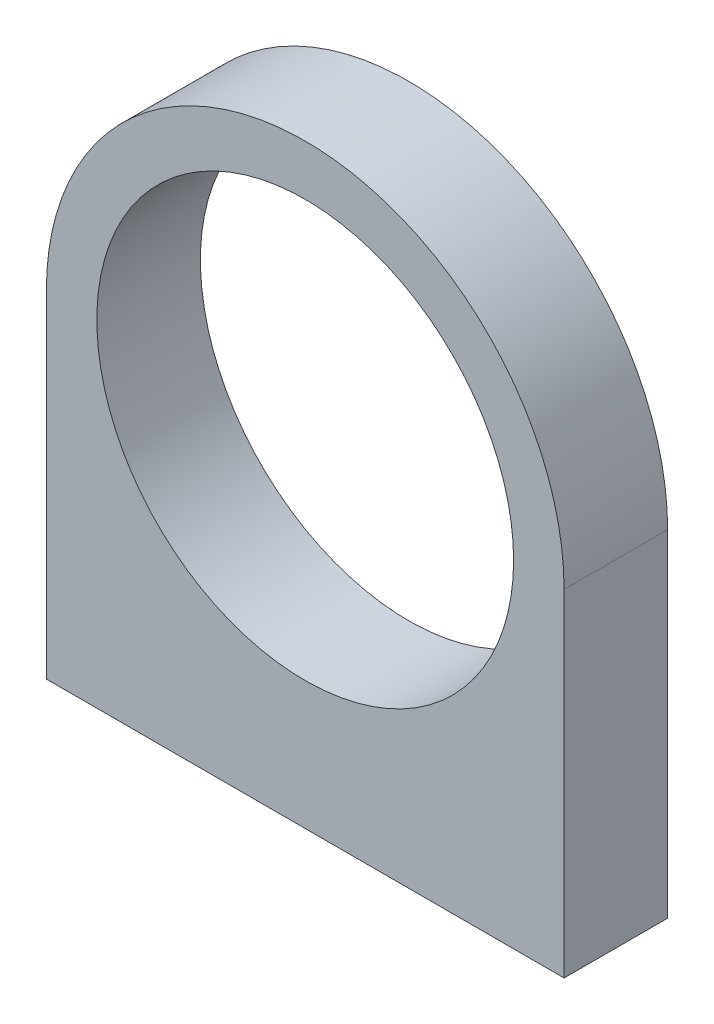
ISO-10303-21;
HEADER;
FILE_DESCRIPTION(('STEP AP214'),'2;1');
FILE_NAME('part.step','',(''),(''),'','','');
FILE_SCHEMA(('AUTOMOTIVE_DESIGN { 1 0 10303 214 1 1 1 1 }'));
ENDSEC;
DATA;
#1=APPLICATION_CONTEXT('core data for automotive mechanical design processes');
#2=APPLICATION_PROTOCOL_DEFINITION('international standard','automotive_design',2000,#1);
#3=PRODUCT_CONTEXT('',#1,'mechanical');
#4=PRODUCT('Part','Part','',(#3));
#5=PRODUCT_RELATED_PRODUCT_CATEGORY('part','',(#4));
#6=PRODUCT_DEFINITION_FORMATION('','',#4);
#7=PRODUCT_DEFINITION_CONTEXT('part definition',#1,'design');
#8=PRODUCT_DEFINITION('design','',#6,#7);
#9=PRODUCT_DEFINITION_SHAPE('','',#8);
#10=(LENGTH_UNIT() NAMED_UNIT(*) SI_UNIT(.MILLI.,.METRE.));
#11=(NAMED_UNIT(*) PLANE_ANGLE_UNIT() SI_UNIT($,.RADIAN.));
#12=(NAMED_UNIT(*) SI_UNIT($,.STERADIAN.) SOLID_ANGLE_UNIT());
#13=UNCERTAINTY_MEASURE_WITH_UNIT(LENGTH_MEASURE(1.E-05),#10,'distance_accuracy_value','');
#14=(GEOMETRIC_REPRESENTATION_CONTEXT(3) GLOBAL_UNCERTAINTY_ASSIGNED_CONTEXT((#13)) GLOBAL_UNIT_ASSIGNED_CONTEXT((#10,
#11,#12)) REPRESENTATION_CONTEXT('',''));
#15=CARTESIAN_POINT('',(0.,0.,0.));
#16=DIRECTION('',(0.,0.,1.));
#17=DIRECTION('',(1.,0.,0.));
#18=AXIS2_PLACEMENT_3D('',#15,#16,#17);
#19=CARTESIAN_POINT('',(0.,0.,8.));
#20=DIRECTION('',(0.,0.,-1.));
#21=DIRECTION('',(-1.,0.,0.));
#22=AXIS2_PLACEMENT_3D('',#19,#20,#21);
#23=PLANE('',#22);
#24=CARTESIAN_POINT('',(0.,0.,8.));
#25=DIRECTION('',(0.,0.,1.));
#26=DIRECTION('',(-1.,0.,0.));
#27=AXIS2_PLACEMENT_3D('',#24,#25,#26);
#28=CIRCLE('',#27,20.);
#29=CARTESIAN_POINT('',(20.,0.,8.));
#30=VERTEX_POINT('',#29);
#31=CARTESIAN_POINT('',(-20.,0.,8.));
#32=VERTEX_POINT('',#31);
#33=EDGE_CURVE('E95',#30,#32,#28,.T.);
#34=ORIENTED_EDGE('',*,*,#33,.T.);
#35=DIRECTION('',(0.,-1.,0.));
#36=VECTOR('',#35,1.);
#37=CARTESIAN_POINT('',(-20.,0.,8.));
#38=LINE('',#37,#36);
#39=CARTESIAN_POINT('',(-20.,-26.,8.));
#40=VERTEX_POINT('',#39);
#41=EDGE_CURVE('E90',#32,#40,#38,.T.);
#42=ORIENTED_EDGE('',*,*,#41,.T.);
#43=DIRECTION('',(1.,0.,0.));
#44=VECTOR('',#43,1.);
#45=CARTESIAN_POINT('',(-20.,-26.,8.));
#46=LINE('',#45,#44);
#47=CARTESIAN_POINT('',(20.,-26.,8.));
#48=VERTEX_POINT('',#47);
#49=EDGE_CURVE('E93',#40,#48,#46,.T.);
#50=ORIENTED_EDGE('',*,*,#49,.T.);
#51=DIRECTION('',(0.,1.,0.));
#52=VECTOR('',#51,1.);
#53=CARTESIAN_POINT('',(20.,0.,8.));
#54=LINE('',#53,#52);
#55=EDGE_CURVE('E60',#48,#30,#54,.T.);
#56=ORIENTED_EDGE('',*,*,#55,.T.);
#57=EDGE_LOOP('',(#34,#42,#50,#56));
#58=FACE_BOUND('',#57,.T.);
#59=CARTESIAN_POINT('',(0.,0.,8.));
#60=DIRECTION('',(0.,0.,1.));
#61=DIRECTION('',(1.,0.,0.));
#62=AXIS2_PLACEMENT_3D('',#59,#60,#61);
#63=CIRCLE('',#62,16.1);
#64=CARTESIAN_POINT('',(16.1,0.,8.));
#65=VERTEX_POINT('',#64);
#66=EDGE_CURVE('E110',#65,#65,#63,.T.);
#67=ORIENTED_EDGE('',*,*,#66,.F.);
#68=EDGE_LOOP('',(#67));
#69=FACE_BOUND('',#68,.T.);
#70=ADVANCED_FACE('F43',(#58,#69),#23,.F.);
#71=CARTESIAN_POINT('',(0.,0.,0.));
#72=DIRECTION('',(0.,0.,-1.));
#73=DIRECTION('',(-1.,0.,0.));
#74=AXIS2_PLACEMENT_3D('',#71,#72,#73);
#75=PLANE('',#74);
#76=CARTESIAN_POINT('',(0.,0.,0.));
#77=DIRECTION('',(0.,0.,1.));
#78=DIRECTION('',(-1.,0.,0.));
#79=AXIS2_PLACEMENT_3D('',#76,#77,#78);
#80=CIRCLE('',#79,20.);
#81=CARTESIAN_POINT('',(20.,0.,0.));
#82=VERTEX_POINT('',#81);
#83=CARTESIAN_POINT('',(-20.,0.,0.));
#84=VERTEX_POINT('',#83);
#85=EDGE_CURVE('E107',#82,#84,#80,.T.);
#86=ORIENTED_EDGE('',*,*,#85,.F.);
#87=DIRECTION('',(0.,1.,0.));
#88=VECTOR('',#87,1.);
#89=CARTESIAN_POINT('',(20.,0.,0.));
#90=LINE('',#89,#88);
#91=CARTESIAN_POINT('',(20.,-26.,0.));
#92=VERTEX_POINT('',#91);
#93=EDGE_CURVE('E83',#92,#82,#90,.T.);
#94=ORIENTED_EDGE('',*,*,#93,.F.);
#95=DIRECTION('',(1.,0.,0.));
#96=VECTOR('',#95,1.);
#97=CARTESIAN_POINT('',(-20.,-26.,0.));
#98=LINE('',#97,#96);
#99=CARTESIAN_POINT('',(-20.,-26.,0.));
#100=VERTEX_POINT('',#99);
#101=EDGE_CURVE('E77',#100,#92,#98,.T.);
#102=ORIENTED_EDGE('',*,*,#101,.F.);
#103=DIRECTION('',(0.,-1.,0.));
#104=VECTOR('',#103,1.);
#105=CARTESIAN_POINT('',(-20.,0.,0.));
#106=LINE('',#105,#104);
#107=EDGE_CURVE('E99',#84,#100,#106,.T.);
#108=ORIENTED_EDGE('',*,*,#107,.F.);
#109=EDGE_LOOP('',(#86,#94,#102,#108));
#110=FACE_BOUND('',#109,.T.);
#111=CARTESIAN_POINT('',(0.,0.,0.));
#112=DIRECTION('',(0.,0.,1.));
#113=DIRECTION('',(1.,0.,0.));
#114=AXIS2_PLACEMENT_3D('',#111,#112,#113);
#115=CIRCLE('',#114,16.1);
#116=CARTESIAN_POINT('',(16.1,0.,0.));
#117=VERTEX_POINT('',#116);
#118=EDGE_CURVE('E122',#117,#117,#115,.T.);
#119=ORIENTED_EDGE('',*,*,#118,.T.);
#120=EDGE_LOOP('',(#119));
#121=FACE_BOUND('',#120,.T.);
#122=ADVANCED_FACE('F118',(#110,#121),#75,.T.);
#123=CARTESIAN_POINT('',(0.,0.,8.));
#124=DIRECTION('',(0.,0.,-1.));
#125=DIRECTION('',(-1.,0.,0.));
#126=AXIS2_PLACEMENT_3D('',#123,#124,#125);
#127=CYLINDRICAL_SURFACE('',#126,20.);
#128=ORIENTED_EDGE('',*,*,#85,.T.);
#129=DIRECTION('',(0.,0.,-1.));
#130=VECTOR('',#129,1.);
#131=CARTESIAN_POINT('',(-20.,0.,8.));
#132=LINE('',#131,#130);
#133=EDGE_CURVE('E11',#32,#84,#132,.T.);
#134=ORIENTED_EDGE('',*,*,#133,.F.);
#135=ORIENTED_EDGE('',*,*,#33,.F.);
#136=DIRECTION('',(0.,0.,-1.));
#137=VECTOR('',#136,1.);
#138=CARTESIAN_POINT('',(20.,0.,8.));
#139=LINE('',#138,#137);
#140=EDGE_CURVE('E103',#30,#82,#139,.T.);
#141=ORIENTED_EDGE('',*,*,#140,.T.);
#142=EDGE_LOOP('',(#128,#134,#135,#141));
#143=FACE_BOUND('',#142,.T.);
#144=ADVANCED_FACE('F45',(#143),#127,.T.);
#145=CARTESIAN_POINT('',(-20.,0.,8.));
#146=DIRECTION('',(1.,0.,0.));
#147=DIRECTION('',(0.,0.,-1.));
#148=AXIS2_PLACEMENT_3D('',#145,#146,#147);
#149=PLANE('',#148);
#150=ORIENTED_EDGE('',*,*,#107,.T.);
#151=DIRECTION('',(0.,0.,-1.));
#152=VECTOR('',#151,1.);
#153=CARTESIAN_POINT('',(-20.,-26.,8.));
#154=LINE('',#153,#152);
#155=EDGE_CURVE('E52',#40,#100,#154,.T.);
#156=ORIENTED_EDGE('',*,*,#155,.F.);
#157=ORIENTED_EDGE('',*,*,#41,.F.);
#158=ORIENTED_EDGE('',*,*,#133,.T.);
#159=EDGE_LOOP('',(#150,#156,#157,#158));
#160=FACE_BOUND('',#159,.T.);
#161=ADVANCED_FACE('F98',(#160),#149,.F.);
#162=CARTESIAN_POINT('',(-20.,-26.,8.));
#163=DIRECTION('',(0.,1.,0.));
#164=DIRECTION('',(0.,0.,1.));
#165=AXIS2_PLACEMENT_3D('',#162,#163,#164);
#166=PLANE('',#165);
#167=CARTESIAN_POINT('',(-16.,-26.,4.));
#168=DIRECTION('',(0.,-1.,0.));
#169=DIRECTION('',(0.,0.,-1.));
#170=AXIS2_PLACEMENT_3D('',#167,#168,#169);
#171=CIRCLE('',#170,1.25);
#172=CARTESIAN_POINT('',(-16.,-26.,2.75));
#173=VERTEX_POINT('',#172);
#174=EDGE_CURVE('E134',#173,#173,#171,.T.);
#175=ORIENTED_EDGE('',*,*,#174,.F.);
#176=EDGE_LOOP('',(#175));
#177=FACE_BOUND('',#176,.T.);
#178=CARTESIAN_POINT('',(16.,-26.,4.00000000000001));
#179=DIRECTION('',(0.,-1.,0.));
#180=DIRECTION('',(0.,0.,-1.));
#181=AXIS2_PLACEMENT_3D('',#178,#179,#180);
#182=CIRCLE('',#181,1.25);
#183=CARTESIAN_POINT('',(16.,-26.,2.75));
#184=VERTEX_POINT('',#183);
#185=EDGE_CURVE('E131',#184,#184,#182,.T.);
#186=ORIENTED_EDGE('',*,*,#185,.F.);
#187=EDGE_LOOP('',(#186));
#188=FACE_BOUND('',#187,.T.);
#189=ORIENTED_EDGE('',*,*,#101,.T.);
#190=DIRECTION('',(0.,0.,-1.));
#191=VECTOR('',#190,1.);
#192=CARTESIAN_POINT('',(20.,-26.,8.));
#193=LINE('',#192,#191);
#194=EDGE_CURVE('E100',#48,#92,#193,.T.);
#195=ORIENTED_EDGE('',*,*,#194,.F.);
#196=ORIENTED_EDGE('',*,*,#49,.F.);
#197=ORIENTED_EDGE('',*,*,#155,.T.);
#198=EDGE_LOOP('',(#189,#195,#196,#197));
#199=FACE_BOUND('',#198,.T.);
#200=ADVANCED_FACE('F101',(#177,#188,#199),#166,.F.);
#201=CARTESIAN_POINT('',(20.,0.,8.));
#202=DIRECTION('',(-1.,0.,0.));
#203=DIRECTION('',(0.,0.,1.));
#204=AXIS2_PLACEMENT_3D('',#201,#202,#203);
#205=PLANE('',#204);
#206=ORIENTED_EDGE('',*,*,#93,.T.);
#207=ORIENTED_EDGE('',*,*,#140,.F.);
#208=ORIENTED_EDGE('',*,*,#55,.F.);
#209=ORIENTED_EDGE('',*,*,#194,.T.);
#210=EDGE_LOOP('',(#206,#207,#208,#209));
#211=FACE_BOUND('',#210,.T.);
#212=ADVANCED_FACE('F115',(#211),#205,.F.);
#213=CARTESIAN_POINT('',(0.,0.,8.));
#214=DIRECTION('',(0.,0.,-1.));
#215=DIRECTION('',(-1.,0.,0.));
#216=AXIS2_PLACEMENT_3D('',#213,#214,#215);
#217=CYLINDRICAL_SURFACE('',#216,16.1);
#218=ORIENTED_EDGE('',*,*,#66,.T.);
#219=EDGE_LOOP('',(#218));
#220=FACE_BOUND('',#219,.T.);
#221=ORIENTED_EDGE('',*,*,#118,.F.);
#222=EDGE_LOOP('',(#221));
#223=FACE_BOUND('',#222,.T.);
#224=ADVANCED_FACE('F156',(#220,#223),#217,.F.);
#225=CARTESIAN_POINT('',(16.,-11.,4.00000000000001));
#226=DIRECTION('',(0.,-1.,0.));
#227=DIRECTION('',(0.,0.,-1.));
#228=AXIS2_PLACEMENT_3D('',#225,#226,#227);
#229=CYLINDRICAL_SURFACE('',#228,1.25);
#230=CARTESIAN_POINT('',(16.,-11.,4.00000000000001));
#231=DIRECTION('',(0.,-1.,0.));
#232=DIRECTION('',(0.,0.,-1.));
#233=AXIS2_PLACEMENT_3D('',#230,#231,#232);
#234=CIRCLE('',#233,1.25);
#235=CARTESIAN_POINT('',(16.,-11.,2.75));
#236=VERTEX_POINT('',#235);
#237=EDGE_CURVE('E128',#236,#236,#234,.T.);
#238=ORIENTED_EDGE('',*,*,#237,.F.);
#239=EDGE_LOOP('',(#238));
#240=FACE_BOUND('',#239,.T.);
#241=ORIENTED_EDGE('',*,*,#185,.T.);
#242=EDGE_LOOP('',(#241));
#243=FACE_BOUND('',#242,.T.);
#244=ADVANCED_FACE('F154',(#240,#243),#229,.F.);
#245=CARTESIAN_POINT('',(16.,-11.,4.00000000000001));
#246=DIRECTION('',(0.,-1.,0.));
#247=DIRECTION('',(0.,0.,-1.));
#248=AXIS2_PLACEMENT_3D('',#245,#246,#247);
#249=PLANE('',#248);
#250=ORIENTED_EDGE('',*,*,#237,.T.);
#251=EDGE_LOOP('',(#250));
#252=FACE_BOUND('',#251,.T.);
#253=ADVANCED_FACE('F145',(#252),#249,.T.);
#254=CARTESIAN_POINT('',(-16.,-11.,4.));
#255=DIRECTION('',(0.,-1.,0.));
#256=DIRECTION('',(0.,0.,-1.));
#257=AXIS2_PLACEMENT_3D('',#254,#255,#256);
#258=CYLINDRICAL_SURFACE('',#257,1.25);
#259=CARTESIAN_POINT('',(-16.,-11.,4.));
#260=DIRECTION('',(0.,-1.,0.));
#261=DIRECTION('',(0.,0.,-1.));
#262=AXIS2_PLACEMENT_3D('',#259,#260,#261);
#263=CIRCLE('',#262,1.25);
#264=CARTESIAN_POINT('',(-16.,-11.,2.75));
#265=VERTEX_POINT('',#264);
#266=EDGE_CURVE('E125',#265,#265,#263,.T.);
#267=ORIENTED_EDGE('',*,*,#266,.F.);
#268=EDGE_LOOP('',(#267));
#269=FACE_BOUND('',#268,.T.);
#270=ORIENTED_EDGE('',*,*,#174,.T.);
#271=EDGE_LOOP('',(#270));
#272=FACE_BOUND('',#271,.T.);
#273=ADVANCED_FACE('F142',(#269,#272),#258,.F.);
#274=CARTESIAN_POINT('',(-16.,-11.,4.));
#275=DIRECTION('',(0.,-1.,0.));
#276=DIRECTION('',(0.,0.,-1.));
#277=AXIS2_PLACEMENT_3D('',#274,#275,#276);
#278=PLANE('',#277);
#279=ORIENTED_EDGE('',*,*,#266,.T.);
#280=EDGE_LOOP('',(#279));
#281=FACE_BOUND('',#280,.T.);
#282=ADVANCED_FACE('F140',(#281),#278,.T.);
#283=CLOSED_SHELL('',(#70,#122,#144,#161,#200,#212,#224,#244,#253,#273,#282));
#284=MANIFOLD_SOLID_BREP('B2',#283);
#285=ADVANCED_BREP_SHAPE_REPRESENTATION('',(#18,#284),#14);
#286=SHAPE_DEFINITION_REPRESENTATION(#9,#285);
ENDSEC;
END-ISO-10303-21;
